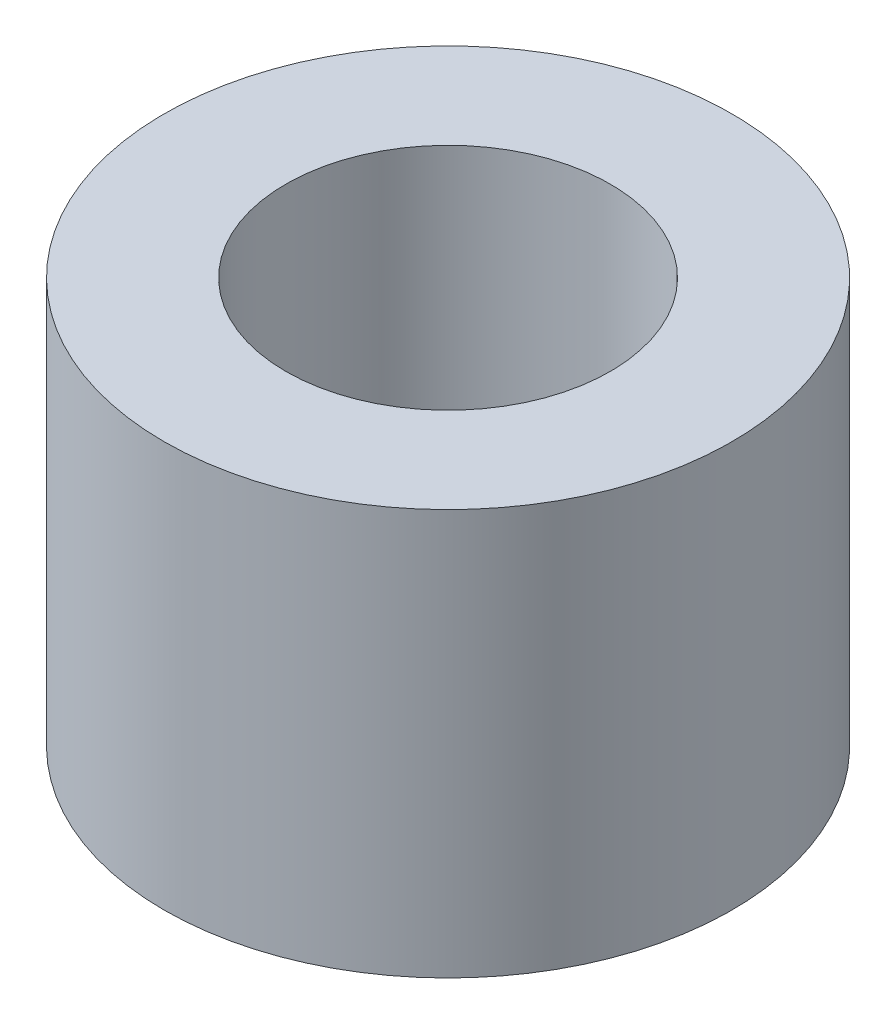
ISO-10303-21;
HEADER;
FILE_DESCRIPTION(('STEP AP214'),'2;1');
FILE_NAME('part.step','',(''),(''),'','','');
FILE_SCHEMA(('AUTOMOTIVE_DESIGN { 1 0 10303 214 1 1 1 1 }'));
ENDSEC;
DATA;
#1=APPLICATION_CONTEXT('core data for automotive mechanical design processes');
#2=APPLICATION_PROTOCOL_DEFINITION('international standard','automotive_design',2000,#1);
#3=PRODUCT_CONTEXT('',#1,'mechanical');
#4=PRODUCT('Part','Part','',(#3));
#5=PRODUCT_RELATED_PRODUCT_CATEGORY('part','',(#4));
#6=PRODUCT_DEFINITION_FORMATION('','',#4);
#7=PRODUCT_DEFINITION_CONTEXT('part definition',#1,'design');
#8=PRODUCT_DEFINITION('design','',#6,#7);
#9=PRODUCT_DEFINITION_SHAPE('','',#8);
#10=(LENGTH_UNIT() NAMED_UNIT(*) SI_UNIT(.MILLI.,.METRE.));
#11=(NAMED_UNIT(*) PLANE_ANGLE_UNIT() SI_UNIT($,.RADIAN.));
#12=(NAMED_UNIT(*) SI_UNIT($,.STERADIAN.) SOLID_ANGLE_UNIT());
#13=UNCERTAINTY_MEASURE_WITH_UNIT(LENGTH_MEASURE(1.E-05),#10,'distance_accuracy_value','');
#14=(GEOMETRIC_REPRESENTATION_CONTEXT(3) GLOBAL_UNCERTAINTY_ASSIGNED_CONTEXT((#13)) GLOBAL_UNIT_ASSIGNED_CONTEXT((#10,
#11,#12)) REPRESENTATION_CONTEXT('',''));
#15=CARTESIAN_POINT('',(0.,0.,0.));
#16=DIRECTION('',(0.,0.,1.));
#17=DIRECTION('',(1.,0.,0.));
#18=AXIS2_PLACEMENT_3D('',#15,#16,#17);
#19=CARTESIAN_POINT('',(-8.31361831357347,5.,-2.07840457839335));
#20=DIRECTION('',(0.,1.,0.));
#21=DIRECTION('',(0.,0.,1.));
#22=AXIS2_PLACEMENT_3D('',#19,#20,#21);
#23=PLANE('',#22);
#24=CARTESIAN_POINT('',(-8.31361831357347,5.,-2.07840457839335));
#25=DIRECTION('',(0.,1.,0.));
#26=DIRECTION('',(0.,0.,1.));
#27=AXIS2_PLACEMENT_3D('',#24,#25,#26);
#28=CIRCLE('',#27,3.5);
#29=CARTESIAN_POINT('',(-8.31361831357347,5.,1.42159542160665));
#30=VERTEX_POINT('',#29);
#31=EDGE_CURVE('E10',#30,#30,#28,.T.);
#32=ORIENTED_EDGE('',*,*,#31,.T.);
#33=EDGE_LOOP('',(#32));
#34=FACE_BOUND('',#33,.T.);
#35=CARTESIAN_POINT('',(-8.31361831357347,5.,-2.07840457839335));
#36=DIRECTION('',(0.,1.,0.));
#37=DIRECTION('',(0.,0.,1.));
#38=AXIS2_PLACEMENT_3D('',#35,#36,#37);
#39=CIRCLE('',#38,2.);
#40=CARTESIAN_POINT('',(-8.31361831357347,5.,-0.0784045783933525));
#41=VERTEX_POINT('',#40);
#42=EDGE_CURVE('E41',#41,#41,#39,.T.);
#43=ORIENTED_EDGE('',*,*,#42,.F.);
#44=EDGE_LOOP('',(#43));
#45=FACE_BOUND('',#44,.T.);
#46=ADVANCED_FACE('F30',(#34,#45),#23,.T.);
#47=CARTESIAN_POINT('',(-8.31361831357347,0.,-2.07840457839335));
#48=DIRECTION('',(0.,1.,0.));
#49=DIRECTION('',(0.,0.,1.));
#50=AXIS2_PLACEMENT_3D('',#47,#48,#49);
#51=PLANE('',#50);
#52=CARTESIAN_POINT('',(-8.31361831357347,0.,-2.07840457839335));
#53=DIRECTION('',(0.,1.,0.));
#54=DIRECTION('',(0.,0.,1.));
#55=AXIS2_PLACEMENT_3D('',#52,#53,#54);
#56=CIRCLE('',#55,3.5);
#57=CARTESIAN_POINT('',(-8.31361831357347,0.,1.42159542160665));
#58=VERTEX_POINT('',#57);
#59=EDGE_CURVE('E34',#58,#58,#56,.T.);
#60=ORIENTED_EDGE('',*,*,#59,.F.);
#61=EDGE_LOOP('',(#60));
#62=FACE_BOUND('',#61,.T.);
#63=CARTESIAN_POINT('',(-8.31361831357347,0.,-2.07840457839335));
#64=DIRECTION('',(0.,1.,0.));
#65=DIRECTION('',(0.,0.,1.));
#66=AXIS2_PLACEMENT_3D('',#63,#64,#65);
#67=CIRCLE('',#66,2.);
#68=CARTESIAN_POINT('',(-8.31361831357347,0.,-0.0784045783933525));
#69=VERTEX_POINT('',#68);
#70=EDGE_CURVE('E43',#69,#69,#67,.T.);
#71=ORIENTED_EDGE('',*,*,#70,.T.);
#72=EDGE_LOOP('',(#71));
#73=FACE_BOUND('',#72,.T.);
#74=ADVANCED_FACE('F53',(#62,#73),#51,.F.);
#75=CARTESIAN_POINT('',(-8.31361831357347,5.,-2.07840457839335));
#76=DIRECTION('',(0.,-1.,0.));
#77=DIRECTION('',(0.,0.,-1.));
#78=AXIS2_PLACEMENT_3D('',#75,#76,#77);
#79=CYLINDRICAL_SURFACE('',#78,3.5);
#80=ORIENTED_EDGE('',*,*,#31,.F.);
#81=EDGE_LOOP('',(#80));
#82=FACE_BOUND('',#81,.T.);
#83=ORIENTED_EDGE('',*,*,#59,.T.);
#84=EDGE_LOOP('',(#83));
#85=FACE_BOUND('',#84,.T.);
#86=ADVANCED_FACE('F32',(#82,#85),#79,.T.);
#87=CARTESIAN_POINT('',(-8.31361831357347,5.,-2.07840457839335));
#88=DIRECTION('',(0.,-1.,0.));
#89=DIRECTION('',(0.,0.,-1.));
#90=AXIS2_PLACEMENT_3D('',#87,#88,#89);
#91=CYLINDRICAL_SURFACE('',#90,2.);
#92=ORIENTED_EDGE('',*,*,#42,.T.);
#93=EDGE_LOOP('',(#92));
#94=FACE_BOUND('',#93,.T.);
#95=ORIENTED_EDGE('',*,*,#70,.F.);
#96=EDGE_LOOP('',(#95));
#97=FACE_BOUND('',#96,.T.);
#98=ADVANCED_FACE('F49',(#94,#97),#91,.F.);
#99=CLOSED_SHELL('',(#46,#74,#86,#98));
#100=MANIFOLD_SOLID_BREP('B2',#99);
#101=ADVANCED_BREP_SHAPE_REPRESENTATION('',(#18,#100),#14);
#102=SHAPE_DEFINITION_REPRESENTATION(#9,#101);
ENDSEC;
END-ISO-10303-21;
